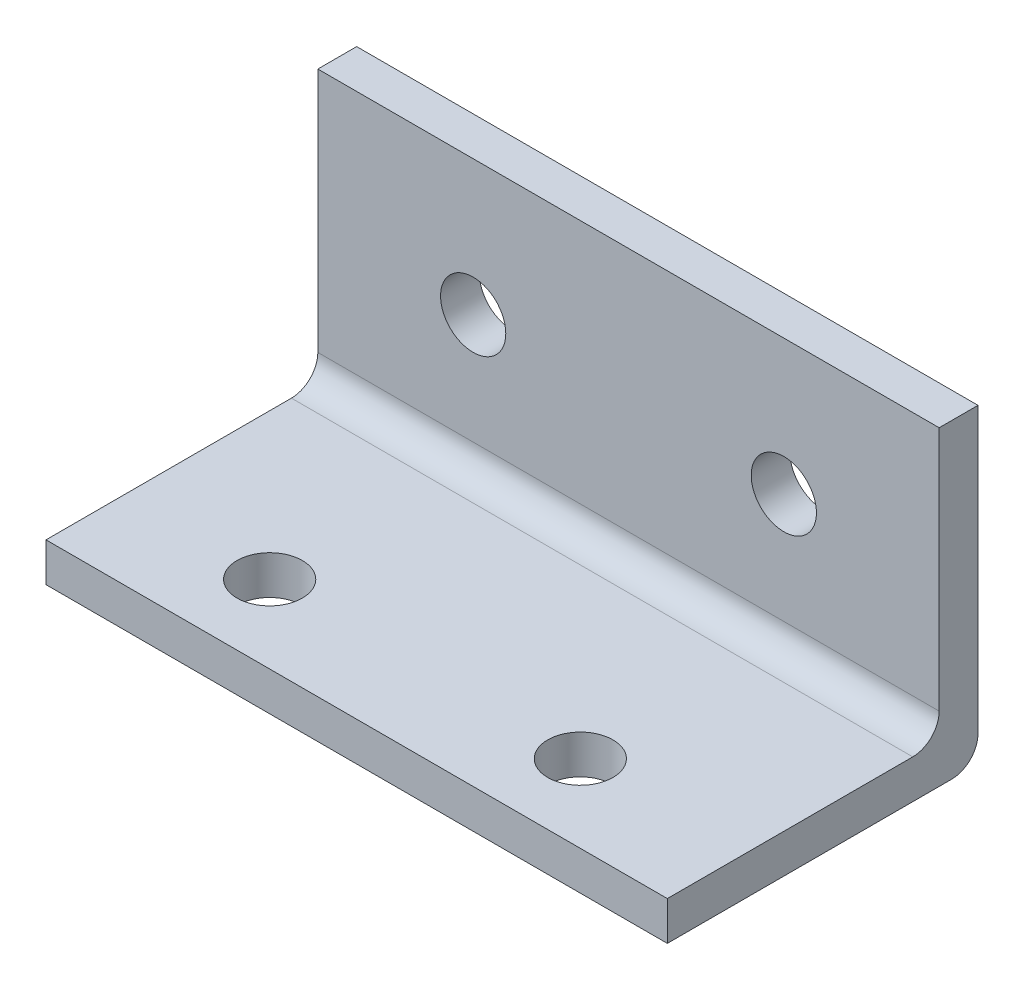
ISO-10303-21;
HEADER;
FILE_DESCRIPTION(('STEP AP214'),'2;1');
FILE_NAME('part.step','',(''),(''),'','','');
FILE_SCHEMA(('AUTOMOTIVE_DESIGN { 1 0 10303 214 1 1 1 1 }'));
ENDSEC;
DATA;
#1=APPLICATION_CONTEXT('core data for automotive mechanical design processes');
#2=APPLICATION_PROTOCOL_DEFINITION('international standard','automotive_design',2000,#1);
#3=PRODUCT_CONTEXT('',#1,'mechanical');
#4=PRODUCT('Part','Part','',(#3));
#5=PRODUCT_RELATED_PRODUCT_CATEGORY('part','',(#4));
#6=PRODUCT_DEFINITION_FORMATION('','',#4);
#7=PRODUCT_DEFINITION_CONTEXT('part definition',#1,'design');
#8=PRODUCT_DEFINITION('design','',#6,#7);
#9=PRODUCT_DEFINITION_SHAPE('','',#8);
#10=(LENGTH_UNIT() NAMED_UNIT(*) SI_UNIT(.MILLI.,.METRE.));
#11=(NAMED_UNIT(*) PLANE_ANGLE_UNIT() SI_UNIT($,.RADIAN.));
#12=(NAMED_UNIT(*) SI_UNIT($,.STERADIAN.) SOLID_ANGLE_UNIT());
#13=UNCERTAINTY_MEASURE_WITH_UNIT(LENGTH_MEASURE(1.E-05),#10,'distance_accuracy_value','');
#14=(GEOMETRIC_REPRESENTATION_CONTEXT(3) GLOBAL_UNCERTAINTY_ASSIGNED_CONTEXT((#13)) GLOBAL_UNIT_ASSIGNED_CONTEXT((#10,
#11,#12)) REPRESENTATION_CONTEXT('',''));
#15=CARTESIAN_POINT('',(0.,0.,0.));
#16=DIRECTION('',(0.,0.,1.));
#17=DIRECTION('',(1.,0.,0.));
#18=AXIS2_PLACEMENT_3D('',#15,#16,#17);
#19=CARTESIAN_POINT('',(50.8,0.,0.));
#20=DIRECTION('',(0.,1.,0.));
#21=DIRECTION('',(0.,0.,1.));
#22=AXIS2_PLACEMENT_3D('',#19,#20,#21);
#23=PLANE('',#22);
#24=CARTESIAN_POINT('',(11.938,0.,19.05));
#25=DIRECTION('',(0.,1.,0.));
#26=DIRECTION('',(0.,0.,1.));
#27=AXIS2_PLACEMENT_3D('',#24,#25,#26);
#28=CIRCLE('',#27,2.667);
#29=CARTESIAN_POINT('',(11.938,0.,21.717));
#30=VERTEX_POINT('',#29);
#31=EDGE_CURVE('E149',#30,#30,#28,.F.);
#32=ORIENTED_EDGE('',*,*,#31,.F.);
#33=EDGE_LOOP('',(#32));
#34=FACE_BOUND('',#33,.T.);
#35=CARTESIAN_POINT('',(37.338,0.,19.05));
#36=DIRECTION('',(0.,1.,0.));
#37=DIRECTION('',(0.,0.,1.));
#38=AXIS2_PLACEMENT_3D('',#35,#36,#37);
#39=CIRCLE('',#38,2.667);
#40=CARTESIAN_POINT('',(37.338,0.,21.717));
#41=VERTEX_POINT('',#40);
#42=EDGE_CURVE('E210',#41,#41,#39,.F.);
#43=ORIENTED_EDGE('',*,*,#42,.F.);
#44=EDGE_LOOP('',(#43));
#45=FACE_BOUND('',#44,.T.);
#46=DIRECTION('',(0.,0.,-1.));
#47=VECTOR('',#46,1.);
#48=CARTESIAN_POINT('',(0.,0.,0.));
#49=LINE('',#48,#47);
#50=CARTESIAN_POINT('',(0.,0.,25.4));
#51=VERTEX_POINT('',#50);
#52=CARTESIAN_POINT('',(0.,0.,2.159));
#53=VERTEX_POINT('',#52);
#54=EDGE_CURVE('E145',#51,#53,#49,.T.);
#55=ORIENTED_EDGE('',*,*,#54,.T.);
#56=DIRECTION('',(-1.,0.,0.));
#57=VECTOR('',#56,1.);
#58=CARTESIAN_POINT('',(50.8,0.,2.159));
#59=LINE('',#58,#57);
#60=CARTESIAN_POINT('',(50.8,0.,2.159));
#61=VERTEX_POINT('',#60);
#62=EDGE_CURVE('E178',#53,#61,#59,.F.);
#63=ORIENTED_EDGE('',*,*,#62,.T.);
#64=DIRECTION('',(0.,0.,-1.));
#65=VECTOR('',#64,1.);
#66=CARTESIAN_POINT('',(50.8,0.,0.));
#67=LINE('',#66,#65);
#68=CARTESIAN_POINT('',(50.8,0.,25.4));
#69=VERTEX_POINT('',#68);
#70=EDGE_CURVE('E116',#69,#61,#67,.T.);
#71=ORIENTED_EDGE('',*,*,#70,.F.);
#72=DIRECTION('',(-1.,0.,0.));
#73=VECTOR('',#72,1.);
#74=CARTESIAN_POINT('',(50.8,0.,25.4));
#75=LINE('',#74,#73);
#76=EDGE_CURVE('E144',#69,#51,#75,.T.);
#77=ORIENTED_EDGE('',*,*,#76,.T.);
#78=EDGE_LOOP('',(#55,#63,#71,#77));
#79=FACE_BOUND('',#78,.T.);
#80=ADVANCED_FACE('F39',(#34,#45,#79),#23,.F.);
#81=CARTESIAN_POINT('',(50.8,0.,0.));
#82=DIRECTION('',(0.,0.,1.));
#83=DIRECTION('',(1.,0.,0.));
#84=AXIS2_PLACEMENT_3D('',#81,#82,#83);
#85=PLANE('',#84);
#86=CARTESIAN_POINT('',(12.7,14.3509999999998,0.));
#87=DIRECTION('',(0.,0.,1.));
#88=DIRECTION('',(1.,0.,0.));
#89=AXIS2_PLACEMENT_3D('',#86,#87,#88);
#90=CIRCLE('',#89,2.667);
#91=CARTESIAN_POINT('',(15.367,14.3509999999998,0.));
#92=VERTEX_POINT('',#91);
#93=EDGE_CURVE('E219',#92,#92,#90,.F.);
#94=ORIENTED_EDGE('',*,*,#93,.F.);
#95=EDGE_LOOP('',(#94));
#96=FACE_BOUND('',#95,.T.);
#97=CARTESIAN_POINT('',(38.1,14.351,0.));
#98=DIRECTION('',(0.,0.,1.));
#99=DIRECTION('',(1.,0.,0.));
#100=AXIS2_PLACEMENT_3D('',#97,#98,#99);
#101=CIRCLE('',#100,2.667);
#102=CARTESIAN_POINT('',(40.767,14.351,0.));
#103=VERTEX_POINT('',#102);
#104=EDGE_CURVE('E226',#103,#103,#101,.F.);
#105=ORIENTED_EDGE('',*,*,#104,.F.);
#106=EDGE_LOOP('',(#105));
#107=FACE_BOUND('',#106,.T.);
#108=DIRECTION('',(0.,1.,0.));
#109=VECTOR('',#108,1.);
#110=CARTESIAN_POINT('',(50.8,0.,0.));
#111=LINE('',#110,#109);
#112=CARTESIAN_POINT('',(50.8,2.159,0.));
#113=VERTEX_POINT('',#112);
#114=CARTESIAN_POINT('',(50.8,25.4,0.));
#115=VERTEX_POINT('',#114);
#116=EDGE_CURVE('E103',#113,#115,#111,.T.);
#117=ORIENTED_EDGE('',*,*,#116,.F.);
#118=DIRECTION('',(-1.,0.,0.));
#119=VECTOR('',#118,1.);
#120=CARTESIAN_POINT('',(50.8,2.159,0.));
#121=LINE('',#120,#119);
#122=CARTESIAN_POINT('',(0.,2.159,0.));
#123=VERTEX_POINT('',#122);
#124=EDGE_CURVE('E126',#113,#123,#121,.T.);
#125=ORIENTED_EDGE('',*,*,#124,.T.);
#126=DIRECTION('',(0.,1.,0.));
#127=VECTOR('',#126,1.);
#128=CARTESIAN_POINT('',(0.,0.,0.));
#129=LINE('',#128,#127);
#130=CARTESIAN_POINT('',(0.,25.4,0.));
#131=VERTEX_POINT('',#130);
#132=EDGE_CURVE('E122',#123,#131,#129,.T.);
#133=ORIENTED_EDGE('',*,*,#132,.T.);
#134=DIRECTION('',(-1.,0.,0.));
#135=VECTOR('',#134,1.);
#136=CARTESIAN_POINT('',(50.8,25.4,0.));
#137=LINE('',#136,#135);
#138=EDGE_CURVE('E119',#115,#131,#137,.T.);
#139=ORIENTED_EDGE('',*,*,#138,.F.);
#140=EDGE_LOOP('',(#117,#125,#133,#139));
#141=FACE_BOUND('',#140,.T.);
#142=ADVANCED_FACE('F120',(#96,#107,#141),#85,.F.);
#143=CARTESIAN_POINT('',(50.8,25.4,3.175));
#144=DIRECTION('',(0.,-1.,0.));
#145=DIRECTION('',(0.,0.,-1.));
#146=AXIS2_PLACEMENT_3D('',#143,#144,#145);
#147=PLANE('',#146);
#148=DIRECTION('',(0.,0.,1.));
#149=VECTOR('',#148,1.);
#150=CARTESIAN_POINT('',(0.,25.4,3.175));
#151=LINE('',#150,#149);
#152=CARTESIAN_POINT('',(0.,25.4,3.175));
#153=VERTEX_POINT('',#152);
#154=EDGE_CURVE('E152',#131,#153,#151,.T.);
#155=ORIENTED_EDGE('',*,*,#154,.T.);
#156=DIRECTION('',(-1.,0.,0.));
#157=VECTOR('',#156,1.);
#158=CARTESIAN_POINT('',(50.8,25.4,3.175));
#159=LINE('',#158,#157);
#160=CARTESIAN_POINT('',(50.8,25.4,3.175));
#161=VERTEX_POINT('',#160);
#162=EDGE_CURVE('E127',#161,#153,#159,.T.);
#163=ORIENTED_EDGE('',*,*,#162,.F.);
#164=DIRECTION('',(0.,0.,1.));
#165=VECTOR('',#164,1.);
#166=CARTESIAN_POINT('',(50.8,25.4,3.175));
#167=LINE('',#166,#165);
#168=EDGE_CURVE('E108',#115,#161,#167,.T.);
#169=ORIENTED_EDGE('',*,*,#168,.F.);
#170=ORIENTED_EDGE('',*,*,#138,.T.);
#171=EDGE_LOOP('',(#155,#163,#169,#170));
#172=FACE_BOUND('',#171,.T.);
#173=ADVANCED_FACE('F129',(#172),#147,.F.);
#174=CARTESIAN_POINT('',(50.8,3.175,3.175));
#175=DIRECTION('',(0.,0.,-1.));
#176=DIRECTION('',(-1.,0.,0.));
#177=AXIS2_PLACEMENT_3D('',#174,#175,#176);
#178=PLANE('',#177);
#179=CARTESIAN_POINT('',(12.7,14.3509999999998,3.175));
#180=DIRECTION('',(0.,0.,1.));
#181=DIRECTION('',(1.,0.,0.));
#182=AXIS2_PLACEMENT_3D('',#179,#180,#181);
#183=CIRCLE('',#182,2.667);
#184=CARTESIAN_POINT('',(15.367,14.3509999999998,3.175));
#185=VERTEX_POINT('',#184);
#186=EDGE_CURVE('E230',#185,#185,#183,.T.);
#187=ORIENTED_EDGE('',*,*,#186,.F.);
#188=EDGE_LOOP('',(#187));
#189=FACE_BOUND('',#188,.T.);
#190=CARTESIAN_POINT('',(38.1,14.351,3.175));
#191=DIRECTION('',(0.,0.,1.));
#192=DIRECTION('',(1.,0.,0.));
#193=AXIS2_PLACEMENT_3D('',#190,#191,#192);
#194=CIRCLE('',#193,2.667);
#195=CARTESIAN_POINT('',(40.767,14.351,3.175));
#196=VERTEX_POINT('',#195);
#197=EDGE_CURVE('E231',#196,#196,#194,.T.);
#198=ORIENTED_EDGE('',*,*,#197,.F.);
#199=EDGE_LOOP('',(#198));
#200=FACE_BOUND('',#199,.T.);
#201=DIRECTION('',(0.,-1.,0.));
#202=VECTOR('',#201,1.);
#203=CARTESIAN_POINT('',(0.,3.175,3.175));
#204=LINE('',#203,#202);
#205=CARTESIAN_POINT('',(0.,5.334,3.175));
#206=VERTEX_POINT('',#205);
#207=EDGE_CURVE('E155',#153,#206,#204,.T.);
#208=ORIENTED_EDGE('',*,*,#207,.T.);
#209=DIRECTION('',(-1.,0.,0.));
#210=VECTOR('',#209,1.);
#211=CARTESIAN_POINT('',(50.8,5.334,3.175));
#212=LINE('',#211,#210);
#213=CARTESIAN_POINT('',(50.8,5.334,3.175));
#214=VERTEX_POINT('',#213);
#215=EDGE_CURVE('E61',#206,#214,#212,.F.);
#216=ORIENTED_EDGE('',*,*,#215,.T.);
#217=DIRECTION('',(0.,-1.,0.));
#218=VECTOR('',#217,1.);
#219=CARTESIAN_POINT('',(50.8,3.175,3.175));
#220=LINE('',#219,#218);
#221=EDGE_CURVE('E132',#161,#214,#220,.T.);
#222=ORIENTED_EDGE('',*,*,#221,.F.);
#223=ORIENTED_EDGE('',*,*,#162,.T.);
#224=EDGE_LOOP('',(#208,#216,#222,#223));
#225=FACE_BOUND('',#224,.T.);
#226=ADVANCED_FACE('F196',(#189,#200,#225),#178,.F.);
#227=CARTESIAN_POINT('',(50.8,3.175,25.4));
#228=DIRECTION('',(0.,-1.,0.));
#229=DIRECTION('',(0.,0.,-1.));
#230=AXIS2_PLACEMENT_3D('',#227,#228,#229);
#231=PLANE('',#230);
#232=CARTESIAN_POINT('',(11.938,3.175,19.05));
#233=DIRECTION('',(0.,1.,0.));
#234=DIRECTION('',(0.,0.,1.));
#235=AXIS2_PLACEMENT_3D('',#232,#233,#234);
#236=CIRCLE('',#235,2.667);
#237=CARTESIAN_POINT('',(11.938,3.175,21.717));
#238=VERTEX_POINT('',#237);
#239=EDGE_CURVE('E214',#238,#238,#236,.T.);
#240=ORIENTED_EDGE('',*,*,#239,.F.);
#241=EDGE_LOOP('',(#240));
#242=FACE_BOUND('',#241,.T.);
#243=CARTESIAN_POINT('',(37.338,3.175,19.05));
#244=DIRECTION('',(0.,1.,0.));
#245=DIRECTION('',(0.,0.,1.));
#246=AXIS2_PLACEMENT_3D('',#243,#244,#245);
#247=CIRCLE('',#246,2.667);
#248=CARTESIAN_POINT('',(37.338,3.175,21.717));
#249=VERTEX_POINT('',#248);
#250=EDGE_CURVE('E215',#249,#249,#247,.T.);
#251=ORIENTED_EDGE('',*,*,#250,.F.);
#252=EDGE_LOOP('',(#251));
#253=FACE_BOUND('',#252,.T.);
#254=DIRECTION('',(0.,0.,1.));
#255=VECTOR('',#254,1.);
#256=CARTESIAN_POINT('',(50.8,3.175,25.4));
#257=LINE('',#256,#255);
#258=CARTESIAN_POINT('',(50.8,3.175,5.334));
#259=VERTEX_POINT('',#258);
#260=CARTESIAN_POINT('',(50.8,3.175,25.4));
#261=VERTEX_POINT('',#260);
#262=EDGE_CURVE('E135',#259,#261,#257,.T.);
#263=ORIENTED_EDGE('',*,*,#262,.F.);
#264=DIRECTION('',(-1.,0.,0.));
#265=VECTOR('',#264,1.);
#266=CARTESIAN_POINT('',(0.,3.175,5.334));
#267=LINE('',#266,#265);
#268=CARTESIAN_POINT('',(0.,3.175,5.334));
#269=VERTEX_POINT('',#268);
#270=EDGE_CURVE('E183',#259,#269,#267,.T.);
#271=ORIENTED_EDGE('',*,*,#270,.T.);
#272=DIRECTION('',(0.,0.,1.));
#273=VECTOR('',#272,1.);
#274=CARTESIAN_POINT('',(0.,3.175,25.4));
#275=LINE('',#274,#273);
#276=CARTESIAN_POINT('',(0.,3.175,25.4));
#277=VERTEX_POINT('',#276);
#278=EDGE_CURVE('E158',#269,#277,#275,.T.);
#279=ORIENTED_EDGE('',*,*,#278,.T.);
#280=DIRECTION('',(-1.,0.,0.));
#281=VECTOR('',#280,1.);
#282=CARTESIAN_POINT('',(50.8,3.175,25.4));
#283=LINE('',#282,#281);
#284=EDGE_CURVE('E167',#261,#277,#283,.T.);
#285=ORIENTED_EDGE('',*,*,#284,.F.);
#286=EDGE_LOOP('',(#263,#271,#279,#285));
#287=FACE_BOUND('',#286,.T.);
#288=ADVANCED_FACE('F198',(#242,#253,#287),#231,.F.);
#289=CARTESIAN_POINT('',(50.8,0.,25.4));
#290=DIRECTION('',(0.,0.,-1.));
#291=DIRECTION('',(-1.,0.,0.));
#292=AXIS2_PLACEMENT_3D('',#289,#290,#291);
#293=PLANE('',#292);
#294=DIRECTION('',(0.,-1.,0.));
#295=VECTOR('',#294,1.);
#296=CARTESIAN_POINT('',(0.,0.,25.4));
#297=LINE('',#296,#295);
#298=EDGE_CURVE('E161',#277,#51,#297,.T.);
#299=ORIENTED_EDGE('',*,*,#298,.T.);
#300=ORIENTED_EDGE('',*,*,#76,.F.);
#301=DIRECTION('',(0.,-1.,0.));
#302=VECTOR('',#301,1.);
#303=CARTESIAN_POINT('',(50.8,0.,25.4));
#304=LINE('',#303,#302);
#305=EDGE_CURVE('E141',#261,#69,#304,.T.);
#306=ORIENTED_EDGE('',*,*,#305,.F.);
#307=ORIENTED_EDGE('',*,*,#284,.T.);
#308=EDGE_LOOP('',(#299,#300,#306,#307));
#309=FACE_BOUND('',#308,.T.);
#310=ADVANCED_FACE('F204',(#309),#293,.F.);
#311=CARTESIAN_POINT('',(50.8,0.,0.));
#312=DIRECTION('',(-1.,0.,0.));
#313=DIRECTION('',(0.,0.,1.));
#314=AXIS2_PLACEMENT_3D('',#311,#312,#313);
#315=PLANE('',#314);
#316=ORIENTED_EDGE('',*,*,#70,.T.);
#317=CARTESIAN_POINT('',(50.8,2.159,2.159));
#318=DIRECTION('',(-1.,0.,0.));
#319=DIRECTION('',(0.,0.,1.));
#320=AXIS2_PLACEMENT_3D('',#317,#318,#319);
#321=CIRCLE('',#320,2.159);
#322=EDGE_CURVE('E111',#61,#113,#321,.F.);
#323=ORIENTED_EDGE('',*,*,#322,.T.);
#324=ORIENTED_EDGE('',*,*,#116,.T.);
#325=ORIENTED_EDGE('',*,*,#168,.T.);
#326=ORIENTED_EDGE('',*,*,#221,.T.);
#327=CARTESIAN_POINT('',(50.8,5.334,5.334));
#328=DIRECTION('',(-1.,0.,0.));
#329=DIRECTION('',(0.,0.,1.));
#330=AXIS2_PLACEMENT_3D('',#327,#328,#329);
#331=CIRCLE('',#330,2.159);
#332=EDGE_CURVE('E11',#214,#259,#331,.T.);
#333=ORIENTED_EDGE('',*,*,#332,.T.);
#334=ORIENTED_EDGE('',*,*,#262,.T.);
#335=ORIENTED_EDGE('',*,*,#305,.T.);
#336=EDGE_LOOP('',(#316,#323,#324,#325,#326,#333,#334,#335));
#337=FACE_BOUND('',#336,.T.);
#338=ADVANCED_FACE('F106',(#337),#315,.F.);
#339=CARTESIAN_POINT('',(0.,0.,0.));
#340=DIRECTION('',(-1.,0.,0.));
#341=DIRECTION('',(0.,0.,1.));
#342=AXIS2_PLACEMENT_3D('',#339,#340,#341);
#343=PLANE('',#342);
#344=ORIENTED_EDGE('',*,*,#132,.F.);
#345=CARTESIAN_POINT('',(0.,2.159,2.159));
#346=DIRECTION('',(-1.,0.,0.));
#347=DIRECTION('',(0.,0.,1.));
#348=AXIS2_PLACEMENT_3D('',#345,#346,#347);
#349=CIRCLE('',#348,2.159);
#350=EDGE_CURVE('E175',#123,#53,#349,.T.);
#351=ORIENTED_EDGE('',*,*,#350,.T.);
#352=ORIENTED_EDGE('',*,*,#54,.F.);
#353=ORIENTED_EDGE('',*,*,#298,.F.);
#354=ORIENTED_EDGE('',*,*,#278,.F.);
#355=CARTESIAN_POINT('',(0.,5.334,5.334));
#356=DIRECTION('',(-1.,0.,0.));
#357=DIRECTION('',(0.,0.,1.));
#358=AXIS2_PLACEMENT_3D('',#355,#356,#357);
#359=CIRCLE('',#358,2.159);
#360=EDGE_CURVE('E48',#269,#206,#359,.F.);
#361=ORIENTED_EDGE('',*,*,#360,.T.);
#362=ORIENTED_EDGE('',*,*,#207,.F.);
#363=ORIENTED_EDGE('',*,*,#154,.F.);
#364=EDGE_LOOP('',(#344,#351,#352,#353,#354,#361,#362,#363));
#365=FACE_BOUND('',#364,.T.);
#366=ADVANCED_FACE('F192',(#365),#343,.T.);
#367=CARTESIAN_POINT('',(37.338,-7.5434151416981,19.05));
#368=DIRECTION('',(0.,1.,0.));
#369=DIRECTION('',(0.,0.,1.));
#370=AXIS2_PLACEMENT_3D('',#367,#368,#369);
#371=CYLINDRICAL_SURFACE('',#370,2.667);
#372=ORIENTED_EDGE('',*,*,#42,.T.);
#373=EDGE_LOOP('',(#372));
#374=FACE_BOUND('',#373,.T.);
#375=ORIENTED_EDGE('',*,*,#250,.T.);
#376=EDGE_LOOP('',(#375));
#377=FACE_BOUND('',#376,.T.);
#378=ADVANCED_FACE('F261',(#374,#377),#371,.F.);
#379=CARTESIAN_POINT('',(11.938,-7.5434151416981,19.05));
#380=DIRECTION('',(0.,1.,0.));
#381=DIRECTION('',(0.,0.,1.));
#382=AXIS2_PLACEMENT_3D('',#379,#380,#381);
#383=CYLINDRICAL_SURFACE('',#382,2.667);
#384=ORIENTED_EDGE('',*,*,#31,.T.);
#385=EDGE_LOOP('',(#384));
#386=FACE_BOUND('',#385,.T.);
#387=ORIENTED_EDGE('',*,*,#239,.T.);
#388=EDGE_LOOP('',(#387));
#389=FACE_BOUND('',#388,.T.);
#390=ADVANCED_FACE('F251',(#386,#389),#383,.F.);
#391=CARTESIAN_POINT('',(38.1,14.351,-7.5434151416981));
#392=DIRECTION('',(0.,0.,1.));
#393=DIRECTION('',(1.,0.,0.));
#394=AXIS2_PLACEMENT_3D('',#391,#392,#393);
#395=CYLINDRICAL_SURFACE('',#394,2.667);
#396=ORIENTED_EDGE('',*,*,#104,.T.);
#397=EDGE_LOOP('',(#396));
#398=FACE_BOUND('',#397,.T.);
#399=ORIENTED_EDGE('',*,*,#197,.T.);
#400=EDGE_LOOP('',(#399));
#401=FACE_BOUND('',#400,.T.);
#402=ADVANCED_FACE('F249',(#398,#401),#395,.F.);
#403=CARTESIAN_POINT('',(12.7,14.3509999999998,-7.5434151416981));
#404=DIRECTION('',(0.,0.,1.));
#405=DIRECTION('',(1.,0.,0.));
#406=AXIS2_PLACEMENT_3D('',#403,#404,#405);
#407=CYLINDRICAL_SURFACE('',#406,2.667);
#408=ORIENTED_EDGE('',*,*,#93,.T.);
#409=EDGE_LOOP('',(#408));
#410=FACE_BOUND('',#409,.T.);
#411=ORIENTED_EDGE('',*,*,#186,.T.);
#412=EDGE_LOOP('',(#411));
#413=FACE_BOUND('',#412,.T.);
#414=ADVANCED_FACE('F242',(#410,#413),#407,.F.);
#415=CARTESIAN_POINT('',(50.8,2.159,2.159));
#416=DIRECTION('',(-1.,0.,0.));
#417=DIRECTION('',(0.,0.,1.));
#418=AXIS2_PLACEMENT_3D('',#415,#416,#417);
#419=CYLINDRICAL_SURFACE('',#418,2.159);
#420=ORIENTED_EDGE('',*,*,#322,.F.);
#421=ORIENTED_EDGE('',*,*,#62,.F.);
#422=ORIENTED_EDGE('',*,*,#350,.F.);
#423=ORIENTED_EDGE('',*,*,#124,.F.);
#424=EDGE_LOOP('',(#420,#421,#422,#423));
#425=FACE_BOUND('',#424,.T.);
#426=ADVANCED_FACE('F258',(#425),#419,.T.);
#427=CARTESIAN_POINT('',(50.8,5.334,5.334));
#428=DIRECTION('',(1.,0.,0.));
#429=DIRECTION('',(0.,0.,-1.));
#430=AXIS2_PLACEMENT_3D('',#427,#428,#429);
#431=CYLINDRICAL_SURFACE('',#430,2.159);
#432=ORIENTED_EDGE('',*,*,#332,.F.);
#433=ORIENTED_EDGE('',*,*,#215,.F.);
#434=ORIENTED_EDGE('',*,*,#360,.F.);
#435=ORIENTED_EDGE('',*,*,#270,.F.);
#436=EDGE_LOOP('',(#432,#433,#434,#435));
#437=FACE_BOUND('',#436,.T.);
#438=ADVANCED_FACE('F41',(#437),#431,.F.);
#439=CLOSED_SHELL('',(#80,#142,#173,#226,#288,#310,#338,#366,#378,#390,#402,#414,#426,#438));
#440=MANIFOLD_SOLID_BREP('B2',#439);
#441=ADVANCED_BREP_SHAPE_REPRESENTATION('',(#18,#440),#14);
#442=SHAPE_DEFINITION_REPRESENTATION(#9,#441);
ENDSEC;
END-ISO-10303-21;
